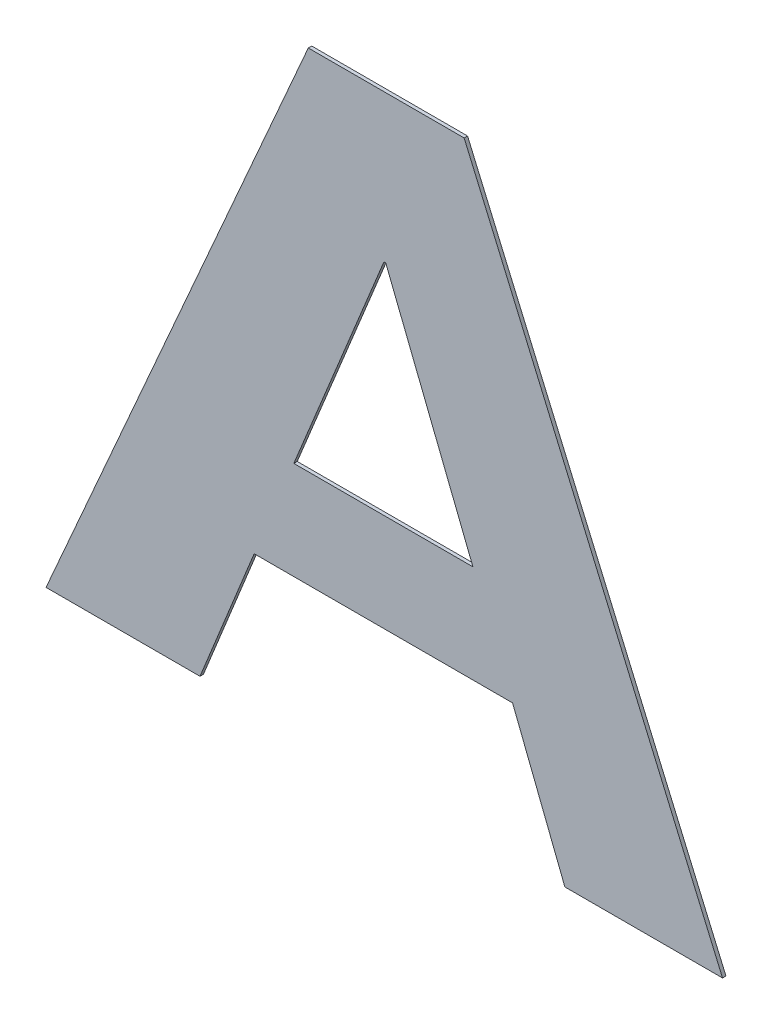
ISO-10303-21;
HEADER;
FILE_DESCRIPTION(('STEP AP214'),'2;1');
FILE_NAME('part.step','',(''),(''),'','','');
FILE_SCHEMA(('AUTOMOTIVE_DESIGN { 1 0 10303 214 1 1 1 1 }'));
ENDSEC;
DATA;
#1=APPLICATION_CONTEXT('core data for automotive mechanical design processes');
#2=APPLICATION_PROTOCOL_DEFINITION('international standard','automotive_design',2000,#1);
#3=PRODUCT_CONTEXT('',#1,'mechanical');
#4=PRODUCT('Part','Part','',(#3));
#5=PRODUCT_RELATED_PRODUCT_CATEGORY('part','',(#4));
#6=PRODUCT_DEFINITION_FORMATION('','',#4);
#7=PRODUCT_DEFINITION_CONTEXT('part definition',#1,'design');
#8=PRODUCT_DEFINITION('design','',#6,#7);
#9=PRODUCT_DEFINITION_SHAPE('','',#8);
#10=(LENGTH_UNIT() NAMED_UNIT(*) SI_UNIT(.MILLI.,.METRE.));
#11=(NAMED_UNIT(*) PLANE_ANGLE_UNIT() SI_UNIT($,.RADIAN.));
#12=(NAMED_UNIT(*) SI_UNIT($,.STERADIAN.) SOLID_ANGLE_UNIT());
#13=UNCERTAINTY_MEASURE_WITH_UNIT(LENGTH_MEASURE(1.E-05),#10,'distance_accuracy_value','');
#14=(GEOMETRIC_REPRESENTATION_CONTEXT(3) GLOBAL_UNCERTAINTY_ASSIGNED_CONTEXT((#13)) GLOBAL_UNIT_ASSIGNED_CONTEXT((#10,
#11,#12)) REPRESENTATION_CONTEXT('',''));
#15=CARTESIAN_POINT('',(0.,0.,0.));
#16=DIRECTION('',(0.,0.,1.));
#17=DIRECTION('',(1.,0.,0.));
#18=AXIS2_PLACEMENT_3D('',#15,#16,#17);
#19=CARTESIAN_POINT('',(0.0588663944509498,0.85207054274705,0.00045));
#20=DIRECTION('',(0.,1.,0.));
#21=DIRECTION('',(0.,0.,1.));
#22=AXIS2_PLACEMENT_3D('',#19,#20,#21);
#23=PLANE('',#22);
#24=DIRECTION('',(0.,0.,1.));
#25=VECTOR('',#24,1.);
#26=CARTESIAN_POINT('',(0.0486064645009498,0.85207054274705,0.));
#27=LINE('',#26,#25);
#28=CARTESIAN_POINT('',(0.0486064645009498,0.85207054274705,0.));
#29=VERTEX_POINT('',#28);
#30=CARTESIAN_POINT('',(0.0486064645009498,0.85207054274705,0.00045));
#31=VERTEX_POINT('',#30);
#32=EDGE_CURVE('E11',#29,#31,#27,.T.);
#33=ORIENTED_EDGE('',*,*,#32,.T.);
#34=DIRECTION('',(1.,0.,0.));
#35=VECTOR('',#34,1.);
#36=CARTESIAN_POINT('',(0.0486064645009498,0.85207054274705,0.00045));
#37=LINE('',#36,#35);
#38=CARTESIAN_POINT('',(0.0691263244009498,0.85207054274705,0.00045));
#39=VERTEX_POINT('',#38);
#40=EDGE_CURVE('E200',#31,#39,#37,.T.);
#41=ORIENTED_EDGE('',*,*,#40,.T.);
#42=DIRECTION('',(0.,0.,1.));
#43=VECTOR('',#42,1.);
#44=CARTESIAN_POINT('',(0.0691263244009498,0.85207054274705,0.));
#45=LINE('',#44,#43);
#46=CARTESIAN_POINT('',(0.0691263244009498,0.85207054274705,0.));
#47=VERTEX_POINT('',#46);
#48=EDGE_CURVE('E24',#47,#39,#45,.T.);
#49=ORIENTED_EDGE('',*,*,#48,.F.);
#50=DIRECTION('',(1.,0.,0.));
#51=VECTOR('',#50,1.);
#52=CARTESIAN_POINT('',(0.0486064645009498,0.85207054274705,0.));
#53=LINE('',#52,#51);
#54=EDGE_CURVE('E188',#29,#47,#53,.T.);
#55=ORIENTED_EDGE('',*,*,#54,.F.);
#56=EDGE_LOOP('',(#33,#41,#49,#55));
#57=FACE_BOUND('',#56,.T.);
#58=ADVANCED_FACE('F17',(#57),#23,.T.);
#59=CARTESIAN_POINT('',(0.0861415526259748,0.8126754605645,0.00045));
#60=DIRECTION('',(0.918030838804518,0.3965089898147,0.));
#61=DIRECTION('',(0.,0.,-1.));
#62=AXIS2_PLACEMENT_3D('',#59,#60,#61);
#63=PLANE('',#62);
#64=ORIENTED_EDGE('',*,*,#48,.T.);
#65=DIRECTION('',(0.3965089898147,-0.918030838804518,0.));
#66=VECTOR('',#65,1.);
#67=CARTESIAN_POINT('',(0.0691263244009498,0.85207054274705,0.00045));
#68=LINE('',#67,#66);
#69=CARTESIAN_POINT('',(0.103156780851,0.77328037838195,0.00045));
#70=VERTEX_POINT('',#69);
#71=EDGE_CURVE('E196',#39,#70,#68,.T.);
#72=ORIENTED_EDGE('',*,*,#71,.T.);
#73=DIRECTION('',(0.,0.,1.));
#74=VECTOR('',#73,1.);
#75=CARTESIAN_POINT('',(0.103156780851,0.77328037838195,0.));
#76=LINE('',#75,#74);
#77=CARTESIAN_POINT('',(0.103156780851,0.77328037838195,0.));
#78=VERTEX_POINT('',#77);
#79=EDGE_CURVE('E198',#78,#70,#76,.T.);
#80=ORIENTED_EDGE('',*,*,#79,.F.);
#81=DIRECTION('',(0.3965089898147,-0.918030838804518,0.));
#82=VECTOR('',#81,1.);
#83=CARTESIAN_POINT('',(0.0691263244009498,0.85207054274705,0.));
#84=LINE('',#83,#82);
#85=EDGE_CURVE('E180',#47,#78,#84,.T.);
#86=ORIENTED_EDGE('',*,*,#85,.F.);
#87=EDGE_LOOP('',(#64,#72,#80,#86));
#88=FACE_BOUND('',#87,.T.);
#89=ADVANCED_FACE('F209',(#88),#63,.T.);
#90=CARTESIAN_POINT('',(0.0927749531259748,0.77328037838195,0.00045));
#91=DIRECTION('',(0.,-1.,0.));
#92=DIRECTION('',(0.,0.,-1.));
#93=AXIS2_PLACEMENT_3D('',#90,#91,#92);
#94=PLANE('',#93);
#95=ORIENTED_EDGE('',*,*,#79,.T.);
#96=DIRECTION('',(-1.,0.,0.));
#97=VECTOR('',#96,1.);
#98=CARTESIAN_POINT('',(0.103156780851,0.77328037838195,0.00045));
#99=LINE('',#98,#97);
#100=CARTESIAN_POINT('',(0.0823931254009498,0.77328037838195,0.00045));
#101=VERTEX_POINT('',#100);
#102=EDGE_CURVE('E191',#70,#101,#99,.T.);
#103=ORIENTED_EDGE('',*,*,#102,.T.);
#104=DIRECTION('',(0.,0.,1.));
#105=VECTOR('',#104,1.);
#106=CARTESIAN_POINT('',(0.0823931254009498,0.77328037838195,0.));
#107=LINE('',#106,#105);
#108=CARTESIAN_POINT('',(0.0823931254009498,0.77328037838195,0.));
#109=VERTEX_POINT('',#108);
#110=EDGE_CURVE('E194',#109,#101,#107,.T.);
#111=ORIENTED_EDGE('',*,*,#110,.F.);
#112=DIRECTION('',(-1.,0.,0.));
#113=VECTOR('',#112,1.);
#114=CARTESIAN_POINT('',(0.103156780851,0.77328037838195,0.));
#115=LINE('',#114,#113);
#116=EDGE_CURVE('E172',#78,#109,#115,.T.);
#117=ORIENTED_EDGE('',*,*,#116,.F.);
#118=EDGE_LOOP('',(#95,#103,#111,#117));
#119=FACE_BOUND('',#118,.T.);
#120=ADVANCED_FACE('F212',(#119),#94,.T.);
#121=CARTESIAN_POINT('',(0.0789494442009748,0.7820541419495,0.00045));
#122=DIRECTION('',(-0.930865350415299,-0.365362421981521,0.));
#123=DIRECTION('',(0.,0.,1.));
#124=AXIS2_PLACEMENT_3D('',#121,#122,#123);
#125=PLANE('',#124);
#126=ORIENTED_EDGE('',*,*,#110,.T.);
#127=DIRECTION('',(-0.365362421981521,0.930865350415299,0.));
#128=VECTOR('',#127,1.);
#129=CARTESIAN_POINT('',(0.0823931254009498,0.77328037838195,0.00045));
#130=LINE('',#129,#128);
#131=CARTESIAN_POINT('',(0.0755057630009998,0.79082790551705,0.00045));
#132=VERTEX_POINT('',#131);
#133=EDGE_CURVE('E183',#101,#132,#130,.T.);
#134=ORIENTED_EDGE('',*,*,#133,.T.);
#135=DIRECTION('',(0.,0.,1.));
#136=VECTOR('',#135,1.);
#137=CARTESIAN_POINT('',(0.0755057630009998,0.79082790551705,0.));
#138=LINE('',#137,#136);
#139=CARTESIAN_POINT('',(0.0755057630009998,0.79082790551705,0.));
#140=VERTEX_POINT('',#139);
#141=EDGE_CURVE('E186',#140,#132,#138,.T.);
#142=ORIENTED_EDGE('',*,*,#141,.F.);
#143=DIRECTION('',(-0.365362421981521,0.930865350415299,0.));
#144=VECTOR('',#143,1.);
#145=CARTESIAN_POINT('',(0.0823931254009498,0.77328037838195,0.));
#146=LINE('',#145,#144);
#147=EDGE_CURVE('E164',#109,#140,#146,.T.);
#148=ORIENTED_EDGE('',*,*,#147,.F.);
#149=EDGE_LOOP('',(#126,#134,#142,#148));
#150=FACE_BOUND('',#149,.T.);
#151=ADVANCED_FACE('F231',(#150),#125,.T.);
#152=CARTESIAN_POINT('',(0.0584905347759748,0.79082790551705,0.00045));
#153=DIRECTION('',(0.,-1.,0.));
#154=DIRECTION('',(0.,0.,-1.));
#155=AXIS2_PLACEMENT_3D('',#152,#153,#154);
#156=PLANE('',#155);
#157=ORIENTED_EDGE('',*,*,#141,.T.);
#158=DIRECTION('',(-1.,0.,0.));
#159=VECTOR('',#158,1.);
#160=CARTESIAN_POINT('',(0.0755057630009998,0.79082790551705,0.00045));
#161=LINE('',#160,#159);
#162=CARTESIAN_POINT('',(0.0414753065509498,0.79082790551705,0.00045));
#163=VERTEX_POINT('',#162);
#164=EDGE_CURVE('E175',#132,#163,#161,.T.);
#165=ORIENTED_EDGE('',*,*,#164,.T.);
#166=DIRECTION('',(0.,0.,1.));
#167=VECTOR('',#166,1.);
#168=CARTESIAN_POINT('',(0.0414753065509498,0.79082790551705,0.));
#169=LINE('',#168,#167);
#170=CARTESIAN_POINT('',(0.0414753065509498,0.79082790551705,0.));
#171=VERTEX_POINT('',#170);
#172=EDGE_CURVE('E178',#171,#163,#169,.T.);
#173=ORIENTED_EDGE('',*,*,#172,.F.);
#174=DIRECTION('',(-1.,0.,0.));
#175=VECTOR('',#174,1.);
#176=CARTESIAN_POINT('',(0.0755057630009998,0.79082790551705,0.));
#177=LINE('',#176,#175);
#178=EDGE_CURVE('E156',#140,#171,#177,.T.);
#179=ORIENTED_EDGE('',*,*,#178,.F.);
#180=EDGE_LOOP('',(#157,#165,#173,#179));
#181=FACE_BOUND('',#180,.T.);
#182=ADVANCED_FACE('F229',(#181),#156,.T.);
#183=CARTESIAN_POINT('',(0.0379097275759498,0.7820541419495,0.00045));
#184=DIRECTION('',(0.926421005522081,-0.37648920373293,0.));
#185=DIRECTION('',(0.,0.,-1.));
#186=AXIS2_PLACEMENT_3D('',#183,#184,#185);
#187=PLANE('',#186);
#188=ORIENTED_EDGE('',*,*,#172,.T.);
#189=DIRECTION('',(-0.37648920373293,-0.926421005522081,0.));
#190=VECTOR('',#189,1.);
#191=CARTESIAN_POINT('',(0.0414753065509498,0.79082790551705,0.00045));
#192=LINE('',#191,#190);
#193=CARTESIAN_POINT('',(0.0343441486009498,0.77328037838195,0.00045));
#194=VERTEX_POINT('',#193);
#195=EDGE_CURVE('E167',#163,#194,#192,.T.);
#196=ORIENTED_EDGE('',*,*,#195,.T.);
#197=DIRECTION('',(0.,0.,1.));
#198=VECTOR('',#197,1.);
#199=CARTESIAN_POINT('',(0.0343441486009498,0.77328037838195,0.));
#200=LINE('',#199,#198);
#201=CARTESIAN_POINT('',(0.0343441486009498,0.77328037838195,0.));
#202=VERTEX_POINT('',#201);
#203=EDGE_CURVE('E170',#202,#194,#200,.T.);
#204=ORIENTED_EDGE('',*,*,#203,.F.);
#205=DIRECTION('',(-0.37648920373293,-0.926421005522081,0.));
#206=VECTOR('',#205,1.);
#207=CARTESIAN_POINT('',(0.0414753065509498,0.79082790551705,0.));
#208=LINE('',#207,#206);
#209=EDGE_CURVE('E150',#171,#202,#208,.T.);
#210=ORIENTED_EDGE('',*,*,#209,.F.);
#211=EDGE_LOOP('',(#188,#196,#204,#210));
#212=FACE_BOUND('',#211,.T.);
#213=ADVANCED_FACE('F226',(#212),#187,.T.);
#214=CARTESIAN_POINT('',(0.0242061164259748,0.77328037838195,0.00045));
#215=DIRECTION('',(0.,-1.,0.));
#216=DIRECTION('',(0.,0.,-1.));
#217=AXIS2_PLACEMENT_3D('',#214,#215,#216);
#218=PLANE('',#217);
#219=ORIENTED_EDGE('',*,*,#203,.T.);
#220=DIRECTION('',(-1.,0.,0.));
#221=VECTOR('',#220,1.);
#222=CARTESIAN_POINT('',(0.0343441486009498,0.77328037838195,0.00045));
#223=LINE('',#222,#221);
#224=CARTESIAN_POINT('',(0.0140680842509998,0.77328037838195,0.00045));
#225=VERTEX_POINT('',#224);
#226=EDGE_CURVE('E159',#194,#225,#223,.T.);
#227=ORIENTED_EDGE('',*,*,#226,.T.);
#228=DIRECTION('',(0.,0.,1.));
#229=VECTOR('',#228,1.);
#230=CARTESIAN_POINT('',(0.0140680842509998,0.77328037838195,0.));
#231=LINE('',#230,#229);
#232=CARTESIAN_POINT('',(0.0140680842509998,0.77328037838195,0.));
#233=VERTEX_POINT('',#232);
#234=EDGE_CURVE('E162',#233,#225,#231,.T.);
#235=ORIENTED_EDGE('',*,*,#234,.F.);
#236=DIRECTION('',(-1.,0.,0.));
#237=VECTOR('',#236,1.);
#238=CARTESIAN_POINT('',(0.0343441486009498,0.77328037838195,0.));
#239=LINE('',#238,#237);
#240=EDGE_CURVE('E142',#202,#233,#239,.T.);
#241=ORIENTED_EDGE('',*,*,#240,.F.);
#242=EDGE_LOOP('',(#219,#227,#235,#241));
#243=FACE_BOUND('',#242,.T.);
#244=ADVANCED_FACE('F222',(#243),#218,.T.);
#245=CARTESIAN_POINT('',(0.0313372743759748,0.8126754605645,0.00045));
#246=DIRECTION('',(-0.915868187999154,0.401479093118367,0.));
#247=DIRECTION('',(0.,0.,1.));
#248=AXIS2_PLACEMENT_3D('',#245,#246,#247);
#249=PLANE('',#248);
#250=ORIENTED_EDGE('',*,*,#234,.T.);
#251=DIRECTION('',(0.401479093118367,0.915868187999154,0.));
#252=VECTOR('',#251,1.);
#253=CARTESIAN_POINT('',(0.0140680842509998,0.77328037838195,0.00045));
#254=LINE('',#253,#252);
#255=EDGE_CURVE('E153',#225,#31,#254,.T.);
#256=ORIENTED_EDGE('',*,*,#255,.T.);
#257=ORIENTED_EDGE('',*,*,#32,.F.);
#258=DIRECTION('',(0.401479093118367,0.915868187999154,0.));
#259=VECTOR('',#258,1.);
#260=CARTESIAN_POINT('',(0.0140680842509998,0.77328037838195,0.));
#261=LINE('',#260,#259);
#262=EDGE_CURVE('E114',#233,#29,#261,.T.);
#263=ORIENTED_EDGE('',*,*,#262,.F.);
#264=EDGE_LOOP('',(#250,#256,#257,#263));
#265=FACE_BOUND('',#264,.T.);
#266=ADVANCED_FACE('F217',(#265),#249,.T.);
#267=CARTESIAN_POINT('',(0.0584905347759748,0.803737131667,0.00045));
#268=DIRECTION('',(0.,1.,0.));
#269=DIRECTION('',(0.,0.,1.));
#270=AXIS2_PLACEMENT_3D('',#267,#268,#269);
#271=PLANE('',#270);
#272=DIRECTION('',(0.,2.46716227694479E-13,1.));
#273=VECTOR('',#272,1.);
#274=CARTESIAN_POINT('',(0.0466966956509998,0.803737131667,0.));
#275=LINE('',#274,#273);
#276=CARTESIAN_POINT('',(0.0466966956509998,0.803737131667,0.));
#277=VERTEX_POINT('',#276);
#278=CARTESIAN_POINT('',(0.0466966956509998,0.803737131667,0.00045));
#279=VERTEX_POINT('',#278);
#280=EDGE_CURVE('E120',#277,#279,#275,.T.);
#281=ORIENTED_EDGE('',*,*,#280,.T.);
#282=DIRECTION('',(1.,0.,0.));
#283=VECTOR('',#282,1.);
#284=CARTESIAN_POINT('',(0.0466966956509998,0.803737131667,0.00045));
#285=LINE('',#284,#283);
#286=CARTESIAN_POINT('',(0.0702843739009498,0.803737131667,0.00045));
#287=VERTEX_POINT('',#286);
#288=EDGE_CURVE('E145',#279,#287,#285,.T.);
#289=ORIENTED_EDGE('',*,*,#288,.T.);
#290=DIRECTION('',(0.,2.46716227694479E-13,1.));
#291=VECTOR('',#290,1.);
#292=CARTESIAN_POINT('',(0.0702843739009498,0.803737131667,0.));
#293=LINE('',#292,#291);
#294=CARTESIAN_POINT('',(0.0702843739009498,0.803737131667,0.));
#295=VERTEX_POINT('',#294);
#296=EDGE_CURVE('E148',#295,#287,#293,.T.);
#297=ORIENTED_EDGE('',*,*,#296,.F.);
#298=DIRECTION('',(1.,0.,0.));
#299=VECTOR('',#298,1.);
#300=CARTESIAN_POINT('',(0.0466966956509998,0.803737131667,0.));
#301=LINE('',#300,#299);
#302=EDGE_CURVE('E132',#277,#295,#301,.T.);
#303=ORIENTED_EDGE('',*,*,#302,.F.);
#304=EDGE_LOOP('',(#281,#289,#297,#303));
#305=FACE_BOUND('',#304,.T.);
#306=ADVANCED_FACE('F250',(#305),#271,.T.);
#307=CARTESIAN_POINT('',(0.0645449073509998,0.818192458039499,0.00045));
#308=DIRECTION('',(-0.929419584354608,-0.369024709495323,0.));
#309=DIRECTION('',(0.,0.,1.));
#310=AXIS2_PLACEMENT_3D('',#307,#308,#309);
#311=PLANE('',#310);
#312=ORIENTED_EDGE('',*,*,#296,.T.);
#313=DIRECTION('',(-0.369024709495323,0.929419584354608,0.));
#314=VECTOR('',#313,1.);
#315=CARTESIAN_POINT('',(0.0702843739009498,0.803737131667,0.00045));
#316=LINE('',#315,#314);
#317=CARTESIAN_POINT('',(0.0588054408010498,0.832647784411999,0.00045));
#318=VERTEX_POINT('',#317);
#319=EDGE_CURVE('E137',#287,#318,#316,.T.);
#320=ORIENTED_EDGE('',*,*,#319,.T.);
#321=DIRECTION('',(0.,0.,1.));
#322=VECTOR('',#321,1.);
#323=CARTESIAN_POINT('',(0.0588054408010498,0.832647784411999,0.));
#324=LINE('',#323,#322);
#325=CARTESIAN_POINT('',(0.0588054408010498,0.832647784411999,0.));
#326=VERTEX_POINT('',#325);
#327=EDGE_CURVE('E140',#326,#318,#324,.T.);
#328=ORIENTED_EDGE('',*,*,#327,.F.);
#329=DIRECTION('',(-0.369024709495323,0.929419584354608,0.));
#330=VECTOR('',#329,1.);
#331=CARTESIAN_POINT('',(0.0702843739009498,0.803737131667,0.));
#332=LINE('',#331,#330);
#333=EDGE_CURVE('E126',#295,#326,#332,.T.);
#334=ORIENTED_EDGE('',*,*,#333,.F.);
#335=EDGE_LOOP('',(#312,#320,#328,#334));
#336=FACE_BOUND('',#335,.T.);
#337=ADVANCED_FACE('F267',(#336),#311,.T.);
#338=CARTESIAN_POINT('',(0.0586835430260248,0.832647784411999,0.00045));
#339=DIRECTION('',(0.,-1.,0.));
#340=DIRECTION('',(0.,0.,-1.));
#341=AXIS2_PLACEMENT_3D('',#338,#339,#340);
#342=PLANE('',#341);
#343=ORIENTED_EDGE('',*,*,#327,.T.);
#344=DIRECTION('',(-1.,0.,0.));
#345=VECTOR('',#344,1.);
#346=CARTESIAN_POINT('',(0.0588054408010498,0.832647784411999,0.00045));
#347=LINE('',#346,#345);
#348=CARTESIAN_POINT('',(0.0585616452509998,0.832647784411999,0.00045));
#349=VERTEX_POINT('',#348);
#350=EDGE_CURVE('E110',#318,#349,#347,.T.);
#351=ORIENTED_EDGE('',*,*,#350,.T.);
#352=DIRECTION('',(0.,0.,1.));
#353=VECTOR('',#352,1.);
#354=CARTESIAN_POINT('',(0.0585616452509998,0.832647784411999,0.));
#355=LINE('',#354,#353);
#356=CARTESIAN_POINT('',(0.0585616452509998,0.832647784411999,0.));
#357=VERTEX_POINT('',#356);
#358=EDGE_CURVE('E103',#357,#349,#355,.T.);
#359=ORIENTED_EDGE('',*,*,#358,.F.);
#360=DIRECTION('',(-1.,0.,0.));
#361=VECTOR('',#360,1.);
#362=CARTESIAN_POINT('',(0.0588054408010498,0.832647784411999,0.));
#363=LINE('',#362,#361);
#364=EDGE_CURVE('E107',#326,#357,#363,.T.);
#365=ORIENTED_EDGE('',*,*,#364,.F.);
#366=EDGE_LOOP('',(#343,#351,#359,#365));
#367=FACE_BOUND('',#366,.T.);
#368=ADVANCED_FACE('F105',(#367),#342,.T.);
#369=CARTESIAN_POINT('',(0.0526291704509998,0.818192458039499,0.00045));
#370=DIRECTION('',(0.925121765742887,-0.379670539479642,0.));
#371=DIRECTION('',(0.,0.,-1.));
#372=AXIS2_PLACEMENT_3D('',#369,#370,#371);
#373=PLANE('',#372);
#374=ORIENTED_EDGE('',*,*,#358,.T.);
#375=DIRECTION('',(-0.379670539479641,-0.925121765742888,0.));
#376=VECTOR('',#375,1.);
#377=CARTESIAN_POINT('',(0.0585616452509998,0.832647784411999,0.00045));
#378=LINE('',#377,#376);
#379=EDGE_CURVE('E128',#349,#279,#378,.T.);
#380=ORIENTED_EDGE('',*,*,#379,.T.);
#381=ORIENTED_EDGE('',*,*,#280,.F.);
#382=DIRECTION('',(-0.379670539479641,-0.925121765742888,0.));
#383=VECTOR('',#382,1.);
#384=CARTESIAN_POINT('',(0.0585616452509998,0.832647784411999,0.));
#385=LINE('',#384,#383);
#386=EDGE_CURVE('E118',#357,#277,#385,.T.);
#387=ORIENTED_EDGE('',*,*,#386,.F.);
#388=EDGE_LOOP('',(#374,#380,#381,#387));
#389=FACE_BOUND('',#388,.T.);
#390=ADVANCED_FACE('F119',(#389),#373,.T.);
#391=CARTESIAN_POINT('',(0.0586124325509998,0.77328037838195,0.));
#392=DIRECTION('',(0.,0.,1.));
#393=DIRECTION('',(1.,0.,0.));
#394=AXIS2_PLACEMENT_3D('',#391,#392,#393);
#395=PLANE('',#394);
#396=ORIENTED_EDGE('',*,*,#54,.T.);
#397=ORIENTED_EDGE('',*,*,#85,.T.);
#398=ORIENTED_EDGE('',*,*,#116,.T.);
#399=ORIENTED_EDGE('',*,*,#147,.T.);
#400=ORIENTED_EDGE('',*,*,#178,.T.);
#401=ORIENTED_EDGE('',*,*,#209,.T.);
#402=ORIENTED_EDGE('',*,*,#240,.T.);
#403=ORIENTED_EDGE('',*,*,#262,.T.);
#404=EDGE_LOOP('',(#396,#397,#398,#399,#400,#401,#402,#403));
#405=FACE_BOUND('',#404,.T.);
#406=ORIENTED_EDGE('',*,*,#302,.T.);
#407=ORIENTED_EDGE('',*,*,#333,.T.);
#408=ORIENTED_EDGE('',*,*,#364,.T.);
#409=ORIENTED_EDGE('',*,*,#386,.T.);
#410=EDGE_LOOP('',(#406,#407,#408,#409));
#411=FACE_BOUND('',#410,.T.);
#412=ADVANCED_FACE('F124',(#405,#411),#395,.F.);
#413=CARTESIAN_POINT('',(0.0586124325509998,0.77328037838195,0.00045));
#414=DIRECTION('',(0.,0.,1.));
#415=DIRECTION('',(1.,0.,0.));
#416=AXIS2_PLACEMENT_3D('',#413,#414,#415);
#417=PLANE('',#416);
#418=ORIENTED_EDGE('',*,*,#40,.F.);
#419=ORIENTED_EDGE('',*,*,#255,.F.);
#420=ORIENTED_EDGE('',*,*,#226,.F.);
#421=ORIENTED_EDGE('',*,*,#195,.F.);
#422=ORIENTED_EDGE('',*,*,#164,.F.);
#423=ORIENTED_EDGE('',*,*,#133,.F.);
#424=ORIENTED_EDGE('',*,*,#102,.F.);
#425=ORIENTED_EDGE('',*,*,#71,.F.);
#426=EDGE_LOOP('',(#418,#419,#420,#421,#422,#423,#424,#425));
#427=FACE_BOUND('',#426,.T.);
#428=ORIENTED_EDGE('',*,*,#288,.F.);
#429=ORIENTED_EDGE('',*,*,#379,.F.);
#430=ORIENTED_EDGE('',*,*,#350,.F.);
#431=ORIENTED_EDGE('',*,*,#319,.F.);
#432=EDGE_LOOP('',(#428,#429,#430,#431));
#433=FACE_BOUND('',#432,.T.);
#434=ADVANCED_FACE('F206',(#427,#433),#417,.T.);
#435=CLOSED_SHELL('',(#58,#89,#120,#151,#182,#213,#244,#266,#306,#337,#368,#390,#412,#434));
#436=MANIFOLD_SOLID_BREP('B1',#435);
#437=ADVANCED_BREP_SHAPE_REPRESENTATION('',(#18,#436),#14);
#438=SHAPE_DEFINITION_REPRESENTATION(#9,#437);
ENDSEC;
END-ISO-10303-21;
